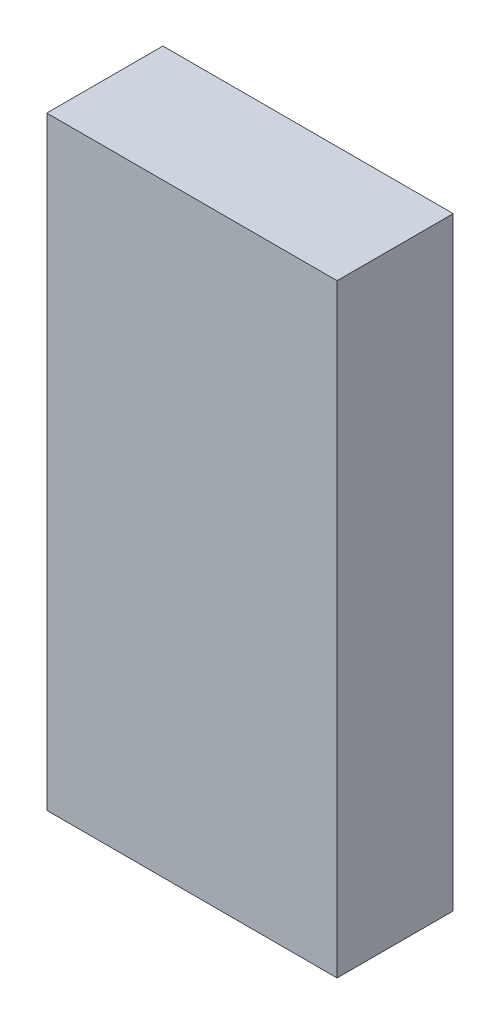
ISO-10303-21;
HEADER;
FILE_DESCRIPTION(('STEP AP214'),'2;1');
FILE_NAME('part.step','',(''),(''),'','','');
FILE_SCHEMA(('AUTOMOTIVE_DESIGN { 1 0 10303 214 1 1 1 1 }'));
ENDSEC;
DATA;
#1=APPLICATION_CONTEXT('core data for automotive mechanical design processes');
#2=APPLICATION_PROTOCOL_DEFINITION('international standard','automotive_design',2000,#1);
#3=PRODUCT_CONTEXT('',#1,'mechanical');
#4=PRODUCT('Part','Part','',(#3));
#5=PRODUCT_RELATED_PRODUCT_CATEGORY('part','',(#4));
#6=PRODUCT_DEFINITION_FORMATION('','',#4);
#7=PRODUCT_DEFINITION_CONTEXT('part definition',#1,'design');
#8=PRODUCT_DEFINITION('design','',#6,#7);
#9=PRODUCT_DEFINITION_SHAPE('','',#8);
#10=(LENGTH_UNIT() NAMED_UNIT(*) SI_UNIT(.MILLI.,.METRE.));
#11=(NAMED_UNIT(*) PLANE_ANGLE_UNIT() SI_UNIT($,.RADIAN.));
#12=(NAMED_UNIT(*) SI_UNIT($,.STERADIAN.) SOLID_ANGLE_UNIT());
#13=UNCERTAINTY_MEASURE_WITH_UNIT(LENGTH_MEASURE(1.E-05),#10,'distance_accuracy_value','');
#14=(GEOMETRIC_REPRESENTATION_CONTEXT(3) GLOBAL_UNCERTAINTY_ASSIGNED_CONTEXT((#13)) GLOBAL_UNIT_ASSIGNED_CONTEXT((#10,
#11,#12)) REPRESENTATION_CONTEXT('',''));
#15=CARTESIAN_POINT('',(0.,0.,0.));
#16=DIRECTION('',(0.,0.,1.));
#17=DIRECTION('',(1.,0.,0.));
#18=AXIS2_PLACEMENT_3D('',#15,#16,#17);
#19=CARTESIAN_POINT('',(-0.62500002,-1.29999994,0.499999));
#20=DIRECTION('',(0.,0.,-1.));
#21=DIRECTION('',(-1.,0.,0.));
#22=AXIS2_PLACEMENT_3D('',#19,#20,#21);
#23=PLANE('',#22);
#24=DIRECTION('',(0.,1.,0.));
#25=VECTOR('',#24,1.);
#26=CARTESIAN_POINT('',(0.62500002,-1.29999994,0.499999));
#27=LINE('',#26,#25);
#28=CARTESIAN_POINT('',(0.62500002,-1.29999994,0.499999));
#29=VERTEX_POINT('',#28);
#30=CARTESIAN_POINT('',(0.62500002,1.29999994,0.499999));
#31=VERTEX_POINT('',#30);
#32=EDGE_CURVE('E55',#29,#31,#27,.T.);
#33=ORIENTED_EDGE('',*,*,#32,.T.);
#34=DIRECTION('',(1.,0.,0.));
#35=VECTOR('',#34,1.);
#36=CARTESIAN_POINT('',(0.62500002,1.29999994,0.499999));
#37=LINE('',#36,#35);
#38=CARTESIAN_POINT('',(-0.62500002,1.29999994,0.499999));
#39=VERTEX_POINT('',#38);
#40=EDGE_CURVE('E58',#31,#39,#37,.F.);
#41=ORIENTED_EDGE('',*,*,#40,.T.);
#42=DIRECTION('',(0.,1.,0.));
#43=VECTOR('',#42,1.);
#44=CARTESIAN_POINT('',(-0.62500002,1.29999994,0.499999));
#45=LINE('',#44,#43);
#46=CARTESIAN_POINT('',(-0.62500002,-1.29999994,0.499999));
#47=VERTEX_POINT('',#46);
#48=EDGE_CURVE('E60',#39,#47,#45,.F.);
#49=ORIENTED_EDGE('',*,*,#48,.T.);
#50=DIRECTION('',(-1.,0.,0.));
#51=VECTOR('',#50,1.);
#52=CARTESIAN_POINT('',(-0.62500002,-1.29999994,0.499999));
#53=LINE('',#52,#51);
#54=EDGE_CURVE('E20',#29,#47,#53,.T.);
#55=ORIENTED_EDGE('',*,*,#54,.F.);
#56=EDGE_LOOP('',(#33,#41,#49,#55));
#57=FACE_BOUND('',#56,.T.);
#58=ADVANCED_FACE('F17',(#57),#23,.F.);
#59=CARTESIAN_POINT('',(-0.62500002,1.29999994,0.));
#60=DIRECTION('',(1.,0.,0.));
#61=DIRECTION('',(0.,0.,-1.));
#62=AXIS2_PLACEMENT_3D('',#59,#60,#61);
#63=PLANE('',#62);
#64=DIRECTION('',(0.,0.,1.));
#65=VECTOR('',#64,1.);
#66=CARTESIAN_POINT('',(-0.62500002,-1.29999994,0.));
#67=LINE('',#66,#65);
#68=CARTESIAN_POINT('',(-0.62500002,-1.29999994,0.));
#69=VERTEX_POINT('',#68);
#70=EDGE_CURVE('E71',#69,#47,#67,.T.);
#71=ORIENTED_EDGE('',*,*,#70,.T.);
#72=ORIENTED_EDGE('',*,*,#48,.F.);
#73=DIRECTION('',(0.,0.,-1.));
#74=VECTOR('',#73,1.);
#75=CARTESIAN_POINT('',(-0.62500002,1.29999994,0.));
#76=LINE('',#75,#74);
#77=CARTESIAN_POINT('',(-0.62500002,1.29999994,0.));
#78=VERTEX_POINT('',#77);
#79=EDGE_CURVE('E65',#39,#78,#76,.T.);
#80=ORIENTED_EDGE('',*,*,#79,.T.);
#81=DIRECTION('',(0.,1.,0.));
#82=VECTOR('',#81,1.);
#83=CARTESIAN_POINT('',(-0.62500002,-1.29999994,0.));
#84=LINE('',#83,#82);
#85=EDGE_CURVE('E83',#69,#78,#84,.T.);
#86=ORIENTED_EDGE('',*,*,#85,.F.);
#87=EDGE_LOOP('',(#71,#72,#80,#86));
#88=FACE_BOUND('',#87,.T.);
#89=ADVANCED_FACE('F68',(#88),#63,.F.);
#90=CARTESIAN_POINT('',(0.62500002,1.29999994,0.));
#91=DIRECTION('',(0.,-1.,0.));
#92=DIRECTION('',(0.,0.,-1.));
#93=AXIS2_PLACEMENT_3D('',#90,#91,#92);
#94=PLANE('',#93);
#95=ORIENTED_EDGE('',*,*,#79,.F.);
#96=ORIENTED_EDGE('',*,*,#40,.F.);
#97=DIRECTION('',(0.,0.,1.));
#98=VECTOR('',#97,1.);
#99=CARTESIAN_POINT('',(0.62500002,1.29999994,0.));
#100=LINE('',#99,#98);
#101=CARTESIAN_POINT('',(0.62500002,1.29999994,0.));
#102=VERTEX_POINT('',#101);
#103=EDGE_CURVE('E77',#31,#102,#100,.F.);
#104=ORIENTED_EDGE('',*,*,#103,.T.);
#105=DIRECTION('',(-1.,0.,0.));
#106=VECTOR('',#105,1.);
#107=CARTESIAN_POINT('',(-0.62500002,1.29999994,0.));
#108=LINE('',#107,#106);
#109=EDGE_CURVE('E74',#78,#102,#108,.F.);
#110=ORIENTED_EDGE('',*,*,#109,.F.);
#111=EDGE_LOOP('',(#95,#96,#104,#110));
#112=FACE_BOUND('',#111,.T.);
#113=ADVANCED_FACE('F72',(#112),#94,.F.);
#114=CARTESIAN_POINT('',(0.62500002,-1.29999994,0.));
#115=DIRECTION('',(-1.,0.,0.));
#116=DIRECTION('',(0.,0.,1.));
#117=AXIS2_PLACEMENT_3D('',#114,#115,#116);
#118=PLANE('',#117);
#119=ORIENTED_EDGE('',*,*,#103,.F.);
#120=ORIENTED_EDGE('',*,*,#32,.F.);
#121=DIRECTION('',(0.,0.,1.));
#122=VECTOR('',#121,1.);
#123=CARTESIAN_POINT('',(0.62500002,-1.29999994,0.));
#124=LINE('',#123,#122);
#125=CARTESIAN_POINT('',(0.62500002,-1.29999994,0.));
#126=VERTEX_POINT('',#125);
#127=EDGE_CURVE('E35',#29,#126,#124,.F.);
#128=ORIENTED_EDGE('',*,*,#127,.T.);
#129=DIRECTION('',(0.,1.,0.));
#130=VECTOR('',#129,1.);
#131=CARTESIAN_POINT('',(0.62500002,-1.29999994,0.));
#132=LINE('',#131,#130);
#133=EDGE_CURVE('E26',#102,#126,#132,.F.);
#134=ORIENTED_EDGE('',*,*,#133,.F.);
#135=EDGE_LOOP('',(#119,#120,#128,#134));
#136=FACE_BOUND('',#135,.T.);
#137=ADVANCED_FACE('F89',(#136),#118,.F.);
#138=CARTESIAN_POINT('',(-0.62500002,-1.29999994,0.));
#139=DIRECTION('',(0.,1.,0.));
#140=DIRECTION('',(0.,0.,1.));
#141=AXIS2_PLACEMENT_3D('',#138,#139,#140);
#142=PLANE('',#141);
#143=ORIENTED_EDGE('',*,*,#127,.F.);
#144=ORIENTED_EDGE('',*,*,#54,.T.);
#145=ORIENTED_EDGE('',*,*,#70,.F.);
#146=DIRECTION('',(-1.,0.,0.));
#147=VECTOR('',#146,1.);
#148=CARTESIAN_POINT('',(-0.62500002,-1.29999994,0.));
#149=LINE('',#148,#147);
#150=EDGE_CURVE('E11',#126,#69,#149,.T.);
#151=ORIENTED_EDGE('',*,*,#150,.F.);
#152=EDGE_LOOP('',(#143,#144,#145,#151));
#153=FACE_BOUND('',#152,.T.);
#154=ADVANCED_FACE('F91',(#153),#142,.F.);
#155=CARTESIAN_POINT('',(-0.62500002,-1.29999994,0.));
#156=DIRECTION('',(0.,0.,-1.));
#157=DIRECTION('',(-1.,0.,0.));
#158=AXIS2_PLACEMENT_3D('',#155,#156,#157);
#159=PLANE('',#158);
#160=ORIENTED_EDGE('',*,*,#133,.T.);
#161=ORIENTED_EDGE('',*,*,#150,.T.);
#162=ORIENTED_EDGE('',*,*,#85,.T.);
#163=ORIENTED_EDGE('',*,*,#109,.T.);
#164=EDGE_LOOP('',(#160,#161,#162,#163));
#165=FACE_BOUND('',#164,.T.);
#166=ADVANCED_FACE('F88',(#165),#159,.T.);
#167=CLOSED_SHELL('',(#58,#89,#113,#137,#154,#166));
#168=MANIFOLD_SOLID_BREP('B1',#167);
#169=ADVANCED_BREP_SHAPE_REPRESENTATION('',(#18,#168),#14);
#170=SHAPE_DEFINITION_REPRESENTATION(#9,#169);
ENDSEC;
END-ISO-10303-21;
